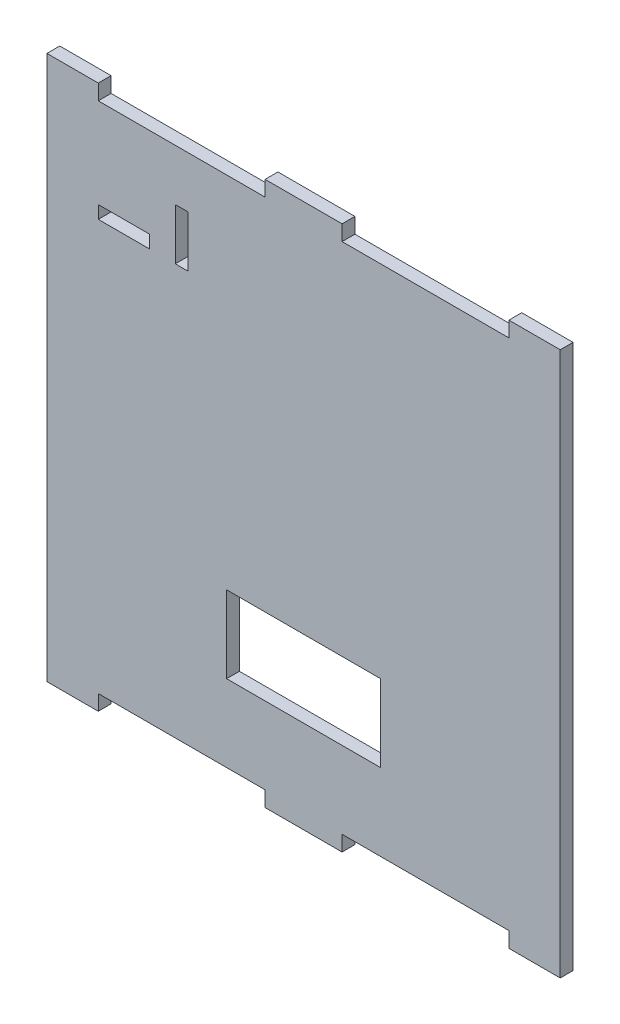
ISO-10303-21;
HEADER;
FILE_DESCRIPTION(('STEP AP214'),'2;1');
FILE_NAME('part.step','',(''),(''),'','','');
FILE_SCHEMA(('AUTOMOTIVE_DESIGN { 1 0 10303 214 1 1 1 1 }'));
ENDSEC;
DATA;
#1=APPLICATION_CONTEXT('core data for automotive mechanical design processes');
#2=APPLICATION_PROTOCOL_DEFINITION('international standard','automotive_design',2000,#1);
#3=PRODUCT_CONTEXT('',#1,'mechanical');
#4=PRODUCT('Part','Part','',(#3));
#5=PRODUCT_RELATED_PRODUCT_CATEGORY('part','',(#4));
#6=PRODUCT_DEFINITION_FORMATION('','',#4);
#7=PRODUCT_DEFINITION_CONTEXT('part definition',#1,'design');
#8=PRODUCT_DEFINITION('design','',#6,#7);
#9=PRODUCT_DEFINITION_SHAPE('','',#8);
#10=(LENGTH_UNIT() NAMED_UNIT(*) SI_UNIT(.MILLI.,.METRE.));
#11=(NAMED_UNIT(*) PLANE_ANGLE_UNIT() SI_UNIT($,.RADIAN.));
#12=(NAMED_UNIT(*) SI_UNIT($,.STERADIAN.) SOLID_ANGLE_UNIT());
#13=UNCERTAINTY_MEASURE_WITH_UNIT(LENGTH_MEASURE(1.E-05),#10,'distance_accuracy_value','');
#14=(GEOMETRIC_REPRESENTATION_CONTEXT(3) GLOBAL_UNCERTAINTY_ASSIGNED_CONTEXT((#13)) GLOBAL_UNIT_ASSIGNED_CONTEXT((#10,
#11,#12)) REPRESENTATION_CONTEXT('',''));
#15=CARTESIAN_POINT('',(0.,0.,0.));
#16=DIRECTION('',(0.,0.,1.));
#17=DIRECTION('',(1.,0.,0.));
#18=AXIS2_PLACEMENT_3D('',#15,#16,#17);
#19=CARTESIAN_POINT('',(0.,0.,5.));
#20=DIRECTION('',(0.,0.,-1.));
#21=DIRECTION('',(-1.,0.,0.));
#22=AXIS2_PLACEMENT_3D('',#19,#20,#21);
#23=PLANE('',#22);
#24=DIRECTION('',(0.,-1.,0.));
#25=VECTOR('',#24,1.);
#26=CARTESIAN_POINT('',(20.,166.,5.));
#27=LINE('',#26,#25);
#28=CARTESIAN_POINT('',(20.,171.,5.));
#29=VERTEX_POINT('',#28);
#30=CARTESIAN_POINT('',(20.,166.,5.));
#31=VERTEX_POINT('',#30);
#32=EDGE_CURVE('E278',#29,#31,#27,.T.);
#33=ORIENTED_EDGE('',*,*,#32,.F.);
#34=DIRECTION('',(-1.,0.,0.));
#35=VECTOR('',#34,1.);
#36=CARTESIAN_POINT('',(20.,171.,5.));
#37=LINE('',#36,#35);
#38=CARTESIAN_POINT('',(40.,171.,5.));
#39=VERTEX_POINT('',#38);
#40=EDGE_CURVE('E286',#39,#29,#37,.T.);
#41=ORIENTED_EDGE('',*,*,#40,.F.);
#42=DIRECTION('',(0.,1.,0.));
#43=VECTOR('',#42,1.);
#44=CARTESIAN_POINT('',(40.,166.,5.));
#45=LINE('',#44,#43);
#46=CARTESIAN_POINT('',(40.,166.,5.));
#47=VERTEX_POINT('',#46);
#48=EDGE_CURVE('E283',#47,#39,#45,.T.);
#49=ORIENTED_EDGE('',*,*,#48,.F.);
#50=DIRECTION('',(1.,0.,0.));
#51=VECTOR('',#50,1.);
#52=CARTESIAN_POINT('',(20.,166.,5.));
#53=LINE('',#52,#51);
#54=EDGE_CURVE('E280',#31,#47,#53,.T.);
#55=ORIENTED_EDGE('',*,*,#54,.F.);
#56=EDGE_LOOP('',(#33,#41,#49,#55));
#57=FACE_BOUND('',#56,.T.);
#58=DIRECTION('',(1.,0.,0.));
#59=VECTOR('',#58,1.);
#60=CARTESIAN_POINT('',(20.,0.,5.));
#61=LINE('',#60,#59);
#62=CARTESIAN_POINT('',(0.,0.,5.));
#63=VERTEX_POINT('',#62);
#64=CARTESIAN_POINT('',(20.,0.,5.));
#65=VERTEX_POINT('',#64);
#66=EDGE_CURVE('E340',#63,#65,#61,.T.);
#67=ORIENTED_EDGE('',*,*,#66,.T.);
#68=DIRECTION('',(0.,1.,0.));
#69=VECTOR('',#68,1.);
#70=CARTESIAN_POINT('',(20.,6.00000000000003,5.));
#71=LINE('',#70,#69);
#72=CARTESIAN_POINT('',(20.,6.00000000000003,5.));
#73=VERTEX_POINT('',#72);
#74=EDGE_CURVE('E343',#65,#73,#71,.T.);
#75=ORIENTED_EDGE('',*,*,#74,.T.);
#76=DIRECTION('',(1.,0.,0.));
#77=VECTOR('',#76,1.);
#78=CARTESIAN_POINT('',(20.,6.00000000000003,5.));
#79=LINE('',#78,#77);
#80=CARTESIAN_POINT('',(85.,6.00000000000003,5.));
#81=VERTEX_POINT('',#80);
#82=EDGE_CURVE('E346',#73,#81,#79,.T.);
#83=ORIENTED_EDGE('',*,*,#82,.T.);
#84=DIRECTION('',(0.,-1.,0.));
#85=VECTOR('',#84,1.);
#86=CARTESIAN_POINT('',(85.,6.00000000000003,5.));
#87=LINE('',#86,#85);
#88=CARTESIAN_POINT('',(85.,0.,5.));
#89=VERTEX_POINT('',#88);
#90=EDGE_CURVE('E348',#81,#89,#87,.T.);
#91=ORIENTED_EDGE('',*,*,#90,.T.);
#92=DIRECTION('',(1.,0.,0.));
#93=VECTOR('',#92,1.);
#94=CARTESIAN_POINT('',(85.,0.,5.));
#95=LINE('',#94,#93);
#96=CARTESIAN_POINT('',(115.,0.,5.));
#97=VERTEX_POINT('',#96);
#98=EDGE_CURVE('E350',#89,#97,#95,.T.);
#99=ORIENTED_EDGE('',*,*,#98,.T.);
#100=DIRECTION('',(0.,1.,0.));
#101=VECTOR('',#100,1.);
#102=CARTESIAN_POINT('',(115.,0.,5.));
#103=LINE('',#102,#101);
#104=CARTESIAN_POINT('',(115.,6.00000000000003,5.));
#105=VERTEX_POINT('',#104);
#106=EDGE_CURVE('E352',#97,#105,#103,.T.);
#107=ORIENTED_EDGE('',*,*,#106,.T.);
#108=DIRECTION('',(1.,0.,0.));
#109=VECTOR('',#108,1.);
#110=CARTESIAN_POINT('',(115.,6.00000000000003,5.));
#111=LINE('',#110,#109);
#112=CARTESIAN_POINT('',(180.,6.00000000000002,5.));
#113=VERTEX_POINT('',#112);
#114=EDGE_CURVE('E354',#105,#113,#111,.T.);
#115=ORIENTED_EDGE('',*,*,#114,.T.);
#116=DIRECTION('',(0.,-1.,0.));
#117=VECTOR('',#116,1.);
#118=CARTESIAN_POINT('',(180.,0.,5.));
#119=LINE('',#118,#117);
#120=CARTESIAN_POINT('',(180.,0.,5.));
#121=VERTEX_POINT('',#120);
#122=EDGE_CURVE('E356',#113,#121,#119,.T.);
#123=ORIENTED_EDGE('',*,*,#122,.T.);
#124=DIRECTION('',(1.,0.,0.));
#125=VECTOR('',#124,1.);
#126=CARTESIAN_POINT('',(200.,0.,5.));
#127=LINE('',#126,#125);
#128=CARTESIAN_POINT('',(200.,0.,5.));
#129=VERTEX_POINT('',#128);
#130=EDGE_CURVE('E358',#121,#129,#127,.T.);
#131=ORIENTED_EDGE('',*,*,#130,.T.);
#132=DIRECTION('',(0.,1.,0.));
#133=VECTOR('',#132,1.);
#134=CARTESIAN_POINT('',(200.,212.,5.));
#135=LINE('',#134,#133);
#136=CARTESIAN_POINT('',(200.,212.,5.));
#137=VERTEX_POINT('',#136);
#138=EDGE_CURVE('E360',#129,#137,#135,.T.);
#139=ORIENTED_EDGE('',*,*,#138,.T.);
#140=DIRECTION('',(-1.,0.,0.));
#141=VECTOR('',#140,1.);
#142=CARTESIAN_POINT('',(180.,212.,5.));
#143=LINE('',#142,#141);
#144=CARTESIAN_POINT('',(180.,212.,5.));
#145=VERTEX_POINT('',#144);
#146=EDGE_CURVE('E362',#137,#145,#143,.T.);
#147=ORIENTED_EDGE('',*,*,#146,.T.);
#148=DIRECTION('',(0.,-1.,0.));
#149=VECTOR('',#148,1.);
#150=CARTESIAN_POINT('',(180.,206.,5.));
#151=LINE('',#150,#149);
#152=CARTESIAN_POINT('',(180.,206.,5.));
#153=VERTEX_POINT('',#152);
#154=EDGE_CURVE('E364',#145,#153,#151,.T.);
#155=ORIENTED_EDGE('',*,*,#154,.T.);
#156=DIRECTION('',(-1.,0.,0.));
#157=VECTOR('',#156,1.);
#158=CARTESIAN_POINT('',(115.,206.,5.));
#159=LINE('',#158,#157);
#160=CARTESIAN_POINT('',(115.,206.,5.));
#161=VERTEX_POINT('',#160);
#162=EDGE_CURVE('E366',#153,#161,#159,.T.);
#163=ORIENTED_EDGE('',*,*,#162,.T.);
#164=DIRECTION('',(0.,1.,0.));
#165=VECTOR('',#164,1.);
#166=CARTESIAN_POINT('',(115.,212.,5.));
#167=LINE('',#166,#165);
#168=CARTESIAN_POINT('',(115.,212.,5.));
#169=VERTEX_POINT('',#168);
#170=EDGE_CURVE('E368',#161,#169,#167,.T.);
#171=ORIENTED_EDGE('',*,*,#170,.T.);
#172=DIRECTION('',(-1.,0.,0.));
#173=VECTOR('',#172,1.);
#174=CARTESIAN_POINT('',(85.,212.,5.));
#175=LINE('',#174,#173);
#176=CARTESIAN_POINT('',(85.,212.,5.));
#177=VERTEX_POINT('',#176);
#178=EDGE_CURVE('E370',#169,#177,#175,.T.);
#179=ORIENTED_EDGE('',*,*,#178,.T.);
#180=DIRECTION('',(0.,-1.,0.));
#181=VECTOR('',#180,1.);
#182=CARTESIAN_POINT('',(85.,206.,5.));
#183=LINE('',#182,#181);
#184=CARTESIAN_POINT('',(85.,206.,5.));
#185=VERTEX_POINT('',#184);
#186=EDGE_CURVE('E372',#177,#185,#183,.T.);
#187=ORIENTED_EDGE('',*,*,#186,.T.);
#188=DIRECTION('',(-1.,0.,0.));
#189=VECTOR('',#188,1.);
#190=CARTESIAN_POINT('',(20.,206.,5.));
#191=LINE('',#190,#189);
#192=CARTESIAN_POINT('',(20.,206.,5.));
#193=VERTEX_POINT('',#192);
#194=EDGE_CURVE('E374',#185,#193,#191,.T.);
#195=ORIENTED_EDGE('',*,*,#194,.T.);
#196=DIRECTION('',(0.,1.,0.));
#197=VECTOR('',#196,1.);
#198=CARTESIAN_POINT('',(20.,212.,5.));
#199=LINE('',#198,#197);
#200=CARTESIAN_POINT('',(20.,212.,5.));
#201=VERTEX_POINT('',#200);
#202=EDGE_CURVE('E376',#193,#201,#199,.T.);
#203=ORIENTED_EDGE('',*,*,#202,.T.);
#204=DIRECTION('',(-1.,0.,0.));
#205=VECTOR('',#204,1.);
#206=CARTESIAN_POINT('',(0.,212.,5.));
#207=LINE('',#206,#205);
#208=CARTESIAN_POINT('',(0.,212.,5.));
#209=VERTEX_POINT('',#208);
#210=EDGE_CURVE('E378',#201,#209,#207,.T.);
#211=ORIENTED_EDGE('',*,*,#210,.T.);
#212=DIRECTION('',(0.,-1.,0.));
#213=VECTOR('',#212,1.);
#214=CARTESIAN_POINT('',(0.,0.,5.));
#215=LINE('',#214,#213);
#216=EDGE_CURVE('E380',#209,#63,#215,.T.);
#217=ORIENTED_EDGE('',*,*,#216,.T.);
#218=EDGE_LOOP('',(#67,#75,#83,#91,#99,#107,#115,#123,#131,#139,#147,#155,#163,#171,#179,#187,
#195,#203,#211,#217));
#219=FACE_BOUND('',#218,.T.);
#220=DIRECTION('',(0.,-1.,0.));
#221=VECTOR('',#220,1.);
#222=CARTESIAN_POINT('',(70.,66.,5.));
#223=LINE('',#222,#221);
#224=CARTESIAN_POINT('',(70.,66.,5.));
#225=VERTEX_POINT('',#224);
#226=CARTESIAN_POINT('',(70.,36.,5.));
#227=VERTEX_POINT('',#226);
#228=EDGE_CURVE('E309',#225,#227,#223,.T.);
#229=ORIENTED_EDGE('',*,*,#228,.F.);
#230=DIRECTION('',(-1.,0.,0.));
#231=VECTOR('',#230,1.);
#232=CARTESIAN_POINT('',(70.,66.,5.));
#233=LINE('',#232,#231);
#234=CARTESIAN_POINT('',(130.,66.,5.));
#235=VERTEX_POINT('',#234);
#236=EDGE_CURVE('E317',#235,#225,#233,.T.);
#237=ORIENTED_EDGE('',*,*,#236,.F.);
#238=DIRECTION('',(0.,1.,0.));
#239=VECTOR('',#238,1.);
#240=CARTESIAN_POINT('',(130.,66.,5.));
#241=LINE('',#240,#239);
#242=CARTESIAN_POINT('',(130.,36.,5.));
#243=VERTEX_POINT('',#242);
#244=EDGE_CURVE('E314',#243,#235,#241,.T.);
#245=ORIENTED_EDGE('',*,*,#244,.F.);
#246=DIRECTION('',(1.,0.,0.));
#247=VECTOR('',#246,1.);
#248=CARTESIAN_POINT('',(70.,36.,5.));
#249=LINE('',#248,#247);
#250=EDGE_CURVE('E311',#227,#243,#249,.T.);
#251=ORIENTED_EDGE('',*,*,#250,.F.);
#252=EDGE_LOOP('',(#229,#237,#245,#251));
#253=FACE_BOUND('',#252,.T.);
#254=DIRECTION('',(0.,-1.,0.));
#255=VECTOR('',#254,1.);
#256=CARTESIAN_POINT('',(50.,186.,5.));
#257=LINE('',#256,#255);
#258=CARTESIAN_POINT('',(50.,186.,5.));
#259=VERTEX_POINT('',#258);
#260=CARTESIAN_POINT('',(50.,166.,5.));
#261=VERTEX_POINT('',#260);
#262=EDGE_CURVE('E242',#259,#261,#257,.T.);
#263=ORIENTED_EDGE('',*,*,#262,.F.);
#264=DIRECTION('',(-1.,0.,0.));
#265=VECTOR('',#264,1.);
#266=CARTESIAN_POINT('',(50.,186.,5.));
#267=LINE('',#266,#265);
#268=CARTESIAN_POINT('',(55.,186.,5.));
#269=VERTEX_POINT('',#268);
#270=EDGE_CURVE('E264',#269,#259,#267,.T.);
#271=ORIENTED_EDGE('',*,*,#270,.F.);
#272=DIRECTION('',(0.,1.,0.));
#273=VECTOR('',#272,1.);
#274=CARTESIAN_POINT('',(55.,186.,5.));
#275=LINE('',#274,#273);
#276=CARTESIAN_POINT('',(55.,166.,5.));
#277=VERTEX_POINT('',#276);
#278=EDGE_CURVE('E262',#277,#269,#275,.T.);
#279=ORIENTED_EDGE('',*,*,#278,.F.);
#280=DIRECTION('',(1.,0.,0.));
#281=VECTOR('',#280,1.);
#282=CARTESIAN_POINT('',(50.,166.,5.));
#283=LINE('',#282,#281);
#284=EDGE_CURVE('E250',#261,#277,#283,.T.);
#285=ORIENTED_EDGE('',*,*,#284,.F.);
#286=EDGE_LOOP('',(#263,#271,#279,#285));
#287=FACE_BOUND('',#286,.T.);
#288=ADVANCED_FACE('F33',(#57,#219,#253,#287),#23,.F.);
#289=CARTESIAN_POINT('',(0.,0.,0.));
#290=DIRECTION('',(0.,0.,-1.));
#291=DIRECTION('',(-1.,0.,0.));
#292=AXIS2_PLACEMENT_3D('',#289,#290,#291);
#293=PLANE('',#292);
#294=DIRECTION('',(1.,0.,0.));
#295=VECTOR('',#294,1.);
#296=CARTESIAN_POINT('',(20.,0.,0.));
#297=LINE('',#296,#295);
#298=CARTESIAN_POINT('',(0.,0.,0.));
#299=VERTEX_POINT('',#298);
#300=CARTESIAN_POINT('',(20.,0.,0.));
#301=VERTEX_POINT('',#300);
#302=EDGE_CURVE('E339',#299,#301,#297,.T.);
#303=ORIENTED_EDGE('',*,*,#302,.F.);
#304=DIRECTION('',(0.,-1.,0.));
#305=VECTOR('',#304,1.);
#306=CARTESIAN_POINT('',(0.,0.,0.));
#307=LINE('',#306,#305);
#308=CARTESIAN_POINT('',(0.,212.,0.));
#309=VERTEX_POINT('',#308);
#310=EDGE_CURVE('E344',#309,#299,#307,.T.);
#311=ORIENTED_EDGE('',*,*,#310,.F.);
#312=DIRECTION('',(-1.,0.,0.));
#313=VECTOR('',#312,1.);
#314=CARTESIAN_POINT('',(0.,212.,0.));
#315=LINE('',#314,#313);
#316=CARTESIAN_POINT('',(20.,212.,0.));
#317=VERTEX_POINT('',#316);
#318=EDGE_CURVE('E419',#317,#309,#315,.T.);
#319=ORIENTED_EDGE('',*,*,#318,.F.);
#320=DIRECTION('',(0.,1.,0.));
#321=VECTOR('',#320,1.);
#322=CARTESIAN_POINT('',(20.,212.,0.));
#323=LINE('',#322,#321);
#324=CARTESIAN_POINT('',(20.,206.,0.));
#325=VERTEX_POINT('',#324);
#326=EDGE_CURVE('E417',#325,#317,#323,.T.);
#327=ORIENTED_EDGE('',*,*,#326,.F.);
#328=DIRECTION('',(-1.,0.,0.));
#329=VECTOR('',#328,1.);
#330=CARTESIAN_POINT('',(20.,206.,0.));
#331=LINE('',#330,#329);
#332=CARTESIAN_POINT('',(85.,206.,0.));
#333=VERTEX_POINT('',#332);
#334=EDGE_CURVE('E415',#333,#325,#331,.T.);
#335=ORIENTED_EDGE('',*,*,#334,.F.);
#336=DIRECTION('',(0.,-1.,0.));
#337=VECTOR('',#336,1.);
#338=CARTESIAN_POINT('',(85.,206.,0.));
#339=LINE('',#338,#337);
#340=CARTESIAN_POINT('',(85.,212.,0.));
#341=VERTEX_POINT('',#340);
#342=EDGE_CURVE('E413',#341,#333,#339,.T.);
#343=ORIENTED_EDGE('',*,*,#342,.F.);
#344=DIRECTION('',(-1.,0.,0.));
#345=VECTOR('',#344,1.);
#346=CARTESIAN_POINT('',(85.,212.,0.));
#347=LINE('',#346,#345);
#348=CARTESIAN_POINT('',(115.,212.,0.));
#349=VERTEX_POINT('',#348);
#350=EDGE_CURVE('E411',#349,#341,#347,.T.);
#351=ORIENTED_EDGE('',*,*,#350,.F.);
#352=DIRECTION('',(0.,1.,0.));
#353=VECTOR('',#352,1.);
#354=CARTESIAN_POINT('',(115.,212.,0.));
#355=LINE('',#354,#353);
#356=CARTESIAN_POINT('',(115.,206.,0.));
#357=VERTEX_POINT('',#356);
#358=EDGE_CURVE('E409',#357,#349,#355,.T.);
#359=ORIENTED_EDGE('',*,*,#358,.F.);
#360=DIRECTION('',(-1.,0.,0.));
#361=VECTOR('',#360,1.);
#362=CARTESIAN_POINT('',(115.,206.,0.));
#363=LINE('',#362,#361);
#364=CARTESIAN_POINT('',(180.,206.,0.));
#365=VERTEX_POINT('',#364);
#366=EDGE_CURVE('E407',#365,#357,#363,.T.);
#367=ORIENTED_EDGE('',*,*,#366,.F.);
#368=DIRECTION('',(0.,-1.,0.));
#369=VECTOR('',#368,1.);
#370=CARTESIAN_POINT('',(180.,206.,0.));
#371=LINE('',#370,#369);
#372=CARTESIAN_POINT('',(180.,212.,0.));
#373=VERTEX_POINT('',#372);
#374=EDGE_CURVE('E405',#373,#365,#371,.T.);
#375=ORIENTED_EDGE('',*,*,#374,.F.);
#376=DIRECTION('',(-1.,0.,0.));
#377=VECTOR('',#376,1.);
#378=CARTESIAN_POINT('',(180.,212.,0.));
#379=LINE('',#378,#377);
#380=CARTESIAN_POINT('',(200.,212.,0.));
#381=VERTEX_POINT('',#380);
#382=EDGE_CURVE('E403',#381,#373,#379,.T.);
#383=ORIENTED_EDGE('',*,*,#382,.F.);
#384=DIRECTION('',(0.,1.,0.));
#385=VECTOR('',#384,1.);
#386=CARTESIAN_POINT('',(200.,212.,0.));
#387=LINE('',#386,#385);
#388=CARTESIAN_POINT('',(200.,0.,0.));
#389=VERTEX_POINT('',#388);
#390=EDGE_CURVE('E401',#389,#381,#387,.T.);
#391=ORIENTED_EDGE('',*,*,#390,.F.);
#392=DIRECTION('',(1.,0.,0.));
#393=VECTOR('',#392,1.);
#394=CARTESIAN_POINT('',(200.,0.,0.));
#395=LINE('',#394,#393);
#396=CARTESIAN_POINT('',(180.,0.,0.));
#397=VERTEX_POINT('',#396);
#398=EDGE_CURVE('E399',#397,#389,#395,.T.);
#399=ORIENTED_EDGE('',*,*,#398,.F.);
#400=DIRECTION('',(0.,-1.,0.));
#401=VECTOR('',#400,1.);
#402=CARTESIAN_POINT('',(180.,0.,0.));
#403=LINE('',#402,#401);
#404=CARTESIAN_POINT('',(180.,6.00000000000002,0.));
#405=VERTEX_POINT('',#404);
#406=EDGE_CURVE('E397',#405,#397,#403,.T.);
#407=ORIENTED_EDGE('',*,*,#406,.F.);
#408=DIRECTION('',(1.,0.,0.));
#409=VECTOR('',#408,1.);
#410=CARTESIAN_POINT('',(115.,6.00000000000003,0.));
#411=LINE('',#410,#409);
#412=CARTESIAN_POINT('',(115.,6.00000000000003,0.));
#413=VERTEX_POINT('',#412);
#414=EDGE_CURVE('E395',#413,#405,#411,.T.);
#415=ORIENTED_EDGE('',*,*,#414,.F.);
#416=DIRECTION('',(0.,1.,0.));
#417=VECTOR('',#416,1.);
#418=CARTESIAN_POINT('',(115.,0.,0.));
#419=LINE('',#418,#417);
#420=CARTESIAN_POINT('',(115.,0.,0.));
#421=VERTEX_POINT('',#420);
#422=EDGE_CURVE('E393',#421,#413,#419,.T.);
#423=ORIENTED_EDGE('',*,*,#422,.F.);
#424=DIRECTION('',(1.,0.,0.));
#425=VECTOR('',#424,1.);
#426=CARTESIAN_POINT('',(85.,0.,0.));
#427=LINE('',#426,#425);
#428=CARTESIAN_POINT('',(85.,0.,0.));
#429=VERTEX_POINT('',#428);
#430=EDGE_CURVE('E391',#429,#421,#427,.T.);
#431=ORIENTED_EDGE('',*,*,#430,.F.);
#432=DIRECTION('',(0.,-1.,0.));
#433=VECTOR('',#432,1.);
#434=CARTESIAN_POINT('',(85.,6.00000000000003,0.));
#435=LINE('',#434,#433);
#436=CARTESIAN_POINT('',(85.,6.00000000000003,0.));
#437=VERTEX_POINT('',#436);
#438=EDGE_CURVE('E389',#437,#429,#435,.T.);
#439=ORIENTED_EDGE('',*,*,#438,.F.);
#440=DIRECTION('',(1.,0.,0.));
#441=VECTOR('',#440,1.);
#442=CARTESIAN_POINT('',(20.,6.00000000000003,0.));
#443=LINE('',#442,#441);
#444=CARTESIAN_POINT('',(20.,6.00000000000003,0.));
#445=VERTEX_POINT('',#444);
#446=EDGE_CURVE('E387',#445,#437,#443,.T.);
#447=ORIENTED_EDGE('',*,*,#446,.F.);
#448=DIRECTION('',(0.,1.,0.));
#449=VECTOR('',#448,1.);
#450=CARTESIAN_POINT('',(20.,6.00000000000003,0.));
#451=LINE('',#450,#449);
#452=EDGE_CURVE('E385',#301,#445,#451,.T.);
#453=ORIENTED_EDGE('',*,*,#452,.F.);
#454=EDGE_LOOP('',(#303,#311,#319,#327,#335,#343,#351,#359,#367,#375,#383,#391,#399,#407,#415,
#423,#431,#439,#447,#453));
#455=FACE_BOUND('',#454,.T.);
#456=DIRECTION('',(-1.,0.,0.));
#457=VECTOR('',#456,1.);
#458=CARTESIAN_POINT('',(70.,66.,0.));
#459=LINE('',#458,#457);
#460=CARTESIAN_POINT('',(130.,66.,0.));
#461=VERTEX_POINT('',#460);
#462=CARTESIAN_POINT('',(70.,66.,0.));
#463=VERTEX_POINT('',#462);
#464=EDGE_CURVE('E312',#461,#463,#459,.T.);
#465=ORIENTED_EDGE('',*,*,#464,.T.);
#466=DIRECTION('',(0.,-1.,0.));
#467=VECTOR('',#466,1.);
#468=CARTESIAN_POINT('',(70.,66.,0.));
#469=LINE('',#468,#467);
#470=CARTESIAN_POINT('',(70.,36.,0.));
#471=VERTEX_POINT('',#470);
#472=EDGE_CURVE('E308',#463,#471,#469,.T.);
#473=ORIENTED_EDGE('',*,*,#472,.T.);
#474=DIRECTION('',(1.,0.,0.));
#475=VECTOR('',#474,1.);
#476=CARTESIAN_POINT('',(70.,36.,0.));
#477=LINE('',#476,#475);
#478=CARTESIAN_POINT('',(130.,36.,0.));
#479=VERTEX_POINT('',#478);
#480=EDGE_CURVE('E322',#471,#479,#477,.T.);
#481=ORIENTED_EDGE('',*,*,#480,.T.);
#482=DIRECTION('',(0.,1.,0.));
#483=VECTOR('',#482,1.);
#484=CARTESIAN_POINT('',(130.,66.,0.));
#485=LINE('',#484,#483);
#486=EDGE_CURVE('E325',#479,#461,#485,.T.);
#487=ORIENTED_EDGE('',*,*,#486,.T.);
#488=EDGE_LOOP('',(#465,#473,#481,#487));
#489=FACE_BOUND('',#488,.T.);
#490=DIRECTION('',(-1.,0.,0.));
#491=VECTOR('',#490,1.);
#492=CARTESIAN_POINT('',(20.,171.,0.));
#493=LINE('',#492,#491);
#494=CARTESIAN_POINT('',(40.,171.,0.));
#495=VERTEX_POINT('',#494);
#496=CARTESIAN_POINT('',(20.,171.,0.));
#497=VERTEX_POINT('',#496);
#498=EDGE_CURVE('E281',#495,#497,#493,.T.);
#499=ORIENTED_EDGE('',*,*,#498,.T.);
#500=DIRECTION('',(0.,-1.,0.));
#501=VECTOR('',#500,1.);
#502=CARTESIAN_POINT('',(20.,166.,0.));
#503=LINE('',#502,#501);
#504=CARTESIAN_POINT('',(20.,166.,0.));
#505=VERTEX_POINT('',#504);
#506=EDGE_CURVE('E258',#497,#505,#503,.T.);
#507=ORIENTED_EDGE('',*,*,#506,.T.);
#508=DIRECTION('',(1.,0.,0.));
#509=VECTOR('',#508,1.);
#510=CARTESIAN_POINT('',(20.,166.,0.));
#511=LINE('',#510,#509);
#512=CARTESIAN_POINT('',(40.,166.,0.));
#513=VERTEX_POINT('',#512);
#514=EDGE_CURVE('E291',#505,#513,#511,.T.);
#515=ORIENTED_EDGE('',*,*,#514,.T.);
#516=DIRECTION('',(0.,1.,0.));
#517=VECTOR('',#516,1.);
#518=CARTESIAN_POINT('',(40.,166.,0.));
#519=LINE('',#518,#517);
#520=EDGE_CURVE('E294',#513,#495,#519,.T.);
#521=ORIENTED_EDGE('',*,*,#520,.T.);
#522=EDGE_LOOP('',(#499,#507,#515,#521));
#523=FACE_BOUND('',#522,.T.);
#524=DIRECTION('',(-1.,0.,0.));
#525=VECTOR('',#524,1.);
#526=CARTESIAN_POINT('',(50.,186.,0.));
#527=LINE('',#526,#525);
#528=CARTESIAN_POINT('',(55.,186.,0.));
#529=VERTEX_POINT('',#528);
#530=CARTESIAN_POINT('',(50.,186.,0.));
#531=VERTEX_POINT('',#530);
#532=EDGE_CURVE('E251',#529,#531,#527,.T.);
#533=ORIENTED_EDGE('',*,*,#532,.T.);
#534=DIRECTION('',(0.,-1.,0.));
#535=VECTOR('',#534,1.);
#536=CARTESIAN_POINT('',(50.,186.,0.));
#537=LINE('',#536,#535);
#538=CARTESIAN_POINT('',(50.,166.,0.));
#539=VERTEX_POINT('',#538);
#540=EDGE_CURVE('E56',#531,#539,#537,.T.);
#541=ORIENTED_EDGE('',*,*,#540,.T.);
#542=DIRECTION('',(1.,0.,0.));
#543=VECTOR('',#542,1.);
#544=CARTESIAN_POINT('',(50.,166.,0.));
#545=LINE('',#544,#543);
#546=CARTESIAN_POINT('',(55.,166.,0.));
#547=VERTEX_POINT('',#546);
#548=EDGE_CURVE('E257',#539,#547,#545,.T.);
#549=ORIENTED_EDGE('',*,*,#548,.T.);
#550=DIRECTION('',(0.,1.,0.));
#551=VECTOR('',#550,1.);
#552=CARTESIAN_POINT('',(55.,186.,0.));
#553=LINE('',#552,#551);
#554=EDGE_CURVE('E270',#547,#529,#553,.T.);
#555=ORIENTED_EDGE('',*,*,#554,.T.);
#556=EDGE_LOOP('',(#533,#541,#549,#555));
#557=FACE_BOUND('',#556,.T.);
#558=ADVANCED_FACE('F485',(#455,#489,#523,#557),#293,.T.);
#559=CARTESIAN_POINT('',(20.,0.,5.));
#560=DIRECTION('',(0.,1.,0.));
#561=DIRECTION('',(0.,0.,1.));
#562=AXIS2_PLACEMENT_3D('',#559,#560,#561);
#563=PLANE('',#562);
#564=ORIENTED_EDGE('',*,*,#302,.T.);
#565=DIRECTION('',(0.,0.,-1.));
#566=VECTOR('',#565,1.);
#567=CARTESIAN_POINT('',(20.,0.,5.));
#568=LINE('',#567,#566);
#569=EDGE_CURVE('E11',#65,#301,#568,.T.);
#570=ORIENTED_EDGE('',*,*,#569,.F.);
#571=ORIENTED_EDGE('',*,*,#66,.F.);
#572=DIRECTION('',(0.,0.,-1.));
#573=VECTOR('',#572,1.);
#574=CARTESIAN_POINT('',(0.,0.,5.));
#575=LINE('',#574,#573);
#576=EDGE_CURVE('E382',#63,#299,#575,.T.);
#577=ORIENTED_EDGE('',*,*,#576,.T.);
#578=EDGE_LOOP('',(#564,#570,#571,#577));
#579=FACE_BOUND('',#578,.T.);
#580=ADVANCED_FACE('F35',(#579),#563,.F.);
#581=CARTESIAN_POINT('',(20.,6.00000000000003,5.));
#582=DIRECTION('',(-1.,0.,0.));
#583=DIRECTION('',(0.,0.,1.));
#584=AXIS2_PLACEMENT_3D('',#581,#582,#583);
#585=PLANE('',#584);
#586=ORIENTED_EDGE('',*,*,#452,.T.);
#587=DIRECTION('',(0.,0.,-1.));
#588=VECTOR('',#587,1.);
#589=CARTESIAN_POINT('',(20.,6.00000000000003,5.));
#590=LINE('',#589,#588);
#591=EDGE_CURVE('E41',#73,#445,#590,.T.);
#592=ORIENTED_EDGE('',*,*,#591,.F.);
#593=ORIENTED_EDGE('',*,*,#74,.F.);
#594=ORIENTED_EDGE('',*,*,#569,.T.);
#595=EDGE_LOOP('',(#586,#592,#593,#594));
#596=FACE_BOUND('',#595,.T.);
#597=ADVANCED_FACE('F503',(#596),#585,.F.);
#598=CARTESIAN_POINT('',(20.,6.00000000000003,5.));
#599=DIRECTION('',(0.,1.,0.));
#600=DIRECTION('',(0.,0.,1.));
#601=AXIS2_PLACEMENT_3D('',#598,#599,#600);
#602=PLANE('',#601);
#603=ORIENTED_EDGE('',*,*,#446,.T.);
#604=DIRECTION('',(0.,0.,-1.));
#605=VECTOR('',#604,1.);
#606=CARTESIAN_POINT('',(85.,6.00000000000003,5.));
#607=LINE('',#606,#605);
#608=EDGE_CURVE('E472',#81,#437,#607,.T.);
#609=ORIENTED_EDGE('',*,*,#608,.F.);
#610=ORIENTED_EDGE('',*,*,#82,.F.);
#611=ORIENTED_EDGE('',*,*,#591,.T.);
#612=EDGE_LOOP('',(#603,#609,#610,#611));
#613=FACE_BOUND('',#612,.T.);
#614=ADVANCED_FACE('F479',(#613),#602,.F.);
#615=CARTESIAN_POINT('',(85.,6.00000000000003,5.));
#616=DIRECTION('',(1.,0.,0.));
#617=DIRECTION('',(0.,0.,-1.));
#618=AXIS2_PLACEMENT_3D('',#615,#616,#617);
#619=PLANE('',#618);
#620=ORIENTED_EDGE('',*,*,#438,.T.);
#621=DIRECTION('',(0.,0.,-1.));
#622=VECTOR('',#621,1.);
#623=CARTESIAN_POINT('',(85.,0.,5.));
#624=LINE('',#623,#622);
#625=EDGE_CURVE('E469',#89,#429,#624,.T.);
#626=ORIENTED_EDGE('',*,*,#625,.F.);
#627=ORIENTED_EDGE('',*,*,#90,.F.);
#628=ORIENTED_EDGE('',*,*,#608,.T.);
#629=EDGE_LOOP('',(#620,#626,#627,#628));
#630=FACE_BOUND('',#629,.T.);
#631=ADVANCED_FACE('F491',(#630),#619,.F.);
#632=CARTESIAN_POINT('',(85.,0.,5.));
#633=DIRECTION('',(0.,1.,0.));
#634=DIRECTION('',(0.,0.,1.));
#635=AXIS2_PLACEMENT_3D('',#632,#633,#634);
#636=PLANE('',#635);
#637=ORIENTED_EDGE('',*,*,#430,.T.);
#638=DIRECTION('',(0.,0.,-1.));
#639=VECTOR('',#638,1.);
#640=CARTESIAN_POINT('',(115.,0.,5.));
#641=LINE('',#640,#639);
#642=EDGE_CURVE('E466',#97,#421,#641,.T.);
#643=ORIENTED_EDGE('',*,*,#642,.F.);
#644=ORIENTED_EDGE('',*,*,#98,.F.);
#645=ORIENTED_EDGE('',*,*,#625,.T.);
#646=EDGE_LOOP('',(#637,#643,#644,#645));
#647=FACE_BOUND('',#646,.T.);
#648=ADVANCED_FACE('F495',(#647),#636,.F.);
#649=CARTESIAN_POINT('',(115.,0.,5.));
#650=DIRECTION('',(-1.,0.,0.));
#651=DIRECTION('',(0.,0.,1.));
#652=AXIS2_PLACEMENT_3D('',#649,#650,#651);
#653=PLANE('',#652);
#654=ORIENTED_EDGE('',*,*,#422,.T.);
#655=DIRECTION('',(0.,0.,-1.));
#656=VECTOR('',#655,1.);
#657=CARTESIAN_POINT('',(115.,6.00000000000003,5.));
#658=LINE('',#657,#656);
#659=EDGE_CURVE('E463',#105,#413,#658,.T.);
#660=ORIENTED_EDGE('',*,*,#659,.F.);
#661=ORIENTED_EDGE('',*,*,#106,.F.);
#662=ORIENTED_EDGE('',*,*,#642,.T.);
#663=EDGE_LOOP('',(#654,#660,#661,#662));
#664=FACE_BOUND('',#663,.T.);
#665=ADVANCED_FACE('F576',(#664),#653,.F.);
#666=CARTESIAN_POINT('',(115.,6.00000000000003,5.));
#667=DIRECTION('',(0.,1.,0.));
#668=DIRECTION('',(-1.,0.,0.));
#669=AXIS2_PLACEMENT_3D('',#666,#667,#668);
#670=PLANE('',#669);
#671=ORIENTED_EDGE('',*,*,#414,.T.);
#672=DIRECTION('',(0.,0.,-1.));
#673=VECTOR('',#672,1.);
#674=CARTESIAN_POINT('',(180.,6.00000000000002,5.));
#675=LINE('',#674,#673);
#676=EDGE_CURVE('E460',#113,#405,#675,.T.);
#677=ORIENTED_EDGE('',*,*,#676,.F.);
#678=ORIENTED_EDGE('',*,*,#114,.F.);
#679=ORIENTED_EDGE('',*,*,#659,.T.);
#680=EDGE_LOOP('',(#671,#677,#678,#679));
#681=FACE_BOUND('',#680,.T.);
#682=ADVANCED_FACE('F574',(#681),#670,.F.);
#683=CARTESIAN_POINT('',(180.,0.,5.));
#684=DIRECTION('',(1.,0.,0.));
#685=DIRECTION('',(0.,0.,-1.));
#686=AXIS2_PLACEMENT_3D('',#683,#684,#685);
#687=PLANE('',#686);
#688=ORIENTED_EDGE('',*,*,#406,.T.);
#689=DIRECTION('',(0.,0.,-1.));
#690=VECTOR('',#689,1.);
#691=CARTESIAN_POINT('',(180.,0.,5.));
#692=LINE('',#691,#690);
#693=EDGE_CURVE('E457',#121,#397,#692,.T.);
#694=ORIENTED_EDGE('',*,*,#693,.F.);
#695=ORIENTED_EDGE('',*,*,#122,.F.);
#696=ORIENTED_EDGE('',*,*,#676,.T.);
#697=EDGE_LOOP('',(#688,#694,#695,#696));
#698=FACE_BOUND('',#697,.T.);
#699=ADVANCED_FACE('F569',(#698),#687,.F.);
#700=CARTESIAN_POINT('',(200.,0.,5.));
#701=DIRECTION('',(0.,1.,0.));
#702=DIRECTION('',(-1.,0.,0.));
#703=AXIS2_PLACEMENT_3D('',#700,#701,#702);
#704=PLANE('',#703);
#705=ORIENTED_EDGE('',*,*,#398,.T.);
#706=DIRECTION('',(0.,0.,-1.));
#707=VECTOR('',#706,1.);
#708=CARTESIAN_POINT('',(200.,0.,5.));
#709=LINE('',#708,#707);
#710=EDGE_CURVE('E454',#129,#389,#709,.T.);
#711=ORIENTED_EDGE('',*,*,#710,.F.);
#712=ORIENTED_EDGE('',*,*,#130,.F.);
#713=ORIENTED_EDGE('',*,*,#693,.T.);
#714=EDGE_LOOP('',(#705,#711,#712,#713));
#715=FACE_BOUND('',#714,.T.);
#716=ADVANCED_FACE('F564',(#715),#704,.F.);
#717=CARTESIAN_POINT('',(200.,212.,5.));
#718=DIRECTION('',(-1.,0.,0.));
#719=DIRECTION('',(0.,-1.,0.));
#720=AXIS2_PLACEMENT_3D('',#717,#718,#719);
#721=PLANE('',#720);
#722=ORIENTED_EDGE('',*,*,#390,.T.);
#723=DIRECTION('',(0.,0.,-1.));
#724=VECTOR('',#723,1.);
#725=CARTESIAN_POINT('',(200.,212.,5.));
#726=LINE('',#725,#724);
#727=EDGE_CURVE('E451',#137,#381,#726,.T.);
#728=ORIENTED_EDGE('',*,*,#727,.F.);
#729=ORIENTED_EDGE('',*,*,#138,.F.);
#730=ORIENTED_EDGE('',*,*,#710,.T.);
#731=EDGE_LOOP('',(#722,#728,#729,#730));
#732=FACE_BOUND('',#731,.T.);
#733=ADVANCED_FACE('F560',(#732),#721,.F.);
#734=CARTESIAN_POINT('',(180.,212.,5.));
#735=DIRECTION('',(0.,-1.,0.));
#736=DIRECTION('',(1.,0.,0.));
#737=AXIS2_PLACEMENT_3D('',#734,#735,#736);
#738=PLANE('',#737);
#739=ORIENTED_EDGE('',*,*,#382,.T.);
#740=DIRECTION('',(0.,0.,-1.));
#741=VECTOR('',#740,1.);
#742=CARTESIAN_POINT('',(180.,212.,5.));
#743=LINE('',#742,#741);
#744=EDGE_CURVE('E448',#145,#373,#743,.T.);
#745=ORIENTED_EDGE('',*,*,#744,.F.);
#746=ORIENTED_EDGE('',*,*,#146,.F.);
#747=ORIENTED_EDGE('',*,*,#727,.T.);
#748=EDGE_LOOP('',(#739,#745,#746,#747));
#749=FACE_BOUND('',#748,.T.);
#750=ADVANCED_FACE('F555',(#749),#738,.F.);
#751=CARTESIAN_POINT('',(180.,206.,5.));
#752=DIRECTION('',(1.,0.,0.));
#753=DIRECTION('',(0.,1.,0.));
#754=AXIS2_PLACEMENT_3D('',#751,#752,#753);
#755=PLANE('',#754);
#756=ORIENTED_EDGE('',*,*,#374,.T.);
#757=DIRECTION('',(0.,0.,-1.));
#758=VECTOR('',#757,1.);
#759=CARTESIAN_POINT('',(180.,206.,5.));
#760=LINE('',#759,#758);
#761=EDGE_CURVE('E445',#153,#365,#760,.T.);
#762=ORIENTED_EDGE('',*,*,#761,.F.);
#763=ORIENTED_EDGE('',*,*,#154,.F.);
#764=ORIENTED_EDGE('',*,*,#744,.T.);
#765=EDGE_LOOP('',(#756,#762,#763,#764));
#766=FACE_BOUND('',#765,.T.);
#767=ADVANCED_FACE('F549',(#766),#755,.F.);
#768=CARTESIAN_POINT('',(115.,206.,5.));
#769=DIRECTION('',(0.,-1.,0.));
#770=DIRECTION('',(1.,0.,0.));
#771=AXIS2_PLACEMENT_3D('',#768,#769,#770);
#772=PLANE('',#771);
#773=ORIENTED_EDGE('',*,*,#366,.T.);
#774=DIRECTION('',(0.,0.,-1.));
#775=VECTOR('',#774,1.);
#776=CARTESIAN_POINT('',(115.,206.,5.));
#777=LINE('',#776,#775);
#778=EDGE_CURVE('E442',#161,#357,#777,.T.);
#779=ORIENTED_EDGE('',*,*,#778,.F.);
#780=ORIENTED_EDGE('',*,*,#162,.F.);
#781=ORIENTED_EDGE('',*,*,#761,.T.);
#782=EDGE_LOOP('',(#773,#779,#780,#781));
#783=FACE_BOUND('',#782,.T.);
#784=ADVANCED_FACE('F545',(#783),#772,.F.);
#785=CARTESIAN_POINT('',(115.,212.,5.));
#786=DIRECTION('',(-1.,0.,0.));
#787=DIRECTION('',(0.,0.,1.));
#788=AXIS2_PLACEMENT_3D('',#785,#786,#787);
#789=PLANE('',#788);
#790=ORIENTED_EDGE('',*,*,#358,.T.);
#791=DIRECTION('',(0.,0.,-1.));
#792=VECTOR('',#791,1.);
#793=CARTESIAN_POINT('',(115.,212.,5.));
#794=LINE('',#793,#792);
#795=EDGE_CURVE('E439',#169,#349,#794,.T.);
#796=ORIENTED_EDGE('',*,*,#795,.F.);
#797=ORIENTED_EDGE('',*,*,#170,.F.);
#798=ORIENTED_EDGE('',*,*,#778,.T.);
#799=EDGE_LOOP('',(#790,#796,#797,#798));
#800=FACE_BOUND('',#799,.T.);
#801=ADVANCED_FACE('F540',(#800),#789,.F.);
#802=CARTESIAN_POINT('',(85.,212.,5.));
#803=DIRECTION('',(0.,-1.,0.));
#804=DIRECTION('',(1.,0.,0.));
#805=AXIS2_PLACEMENT_3D('',#802,#803,#804);
#806=PLANE('',#805);
#807=ORIENTED_EDGE('',*,*,#350,.T.);
#808=DIRECTION('',(0.,0.,-1.));
#809=VECTOR('',#808,1.);
#810=CARTESIAN_POINT('',(85.,212.,5.));
#811=LINE('',#810,#809);
#812=EDGE_CURVE('E436',#177,#341,#811,.T.);
#813=ORIENTED_EDGE('',*,*,#812,.F.);
#814=ORIENTED_EDGE('',*,*,#178,.F.);
#815=ORIENTED_EDGE('',*,*,#795,.T.);
#816=EDGE_LOOP('',(#807,#813,#814,#815));
#817=FACE_BOUND('',#816,.T.);
#818=ADVANCED_FACE('F534',(#817),#806,.F.);
#819=CARTESIAN_POINT('',(85.,206.,5.));
#820=DIRECTION('',(1.,0.,0.));
#821=DIRECTION('',(0.,0.,-1.));
#822=AXIS2_PLACEMENT_3D('',#819,#820,#821);
#823=PLANE('',#822);
#824=ORIENTED_EDGE('',*,*,#342,.T.);
#825=DIRECTION('',(0.,0.,-1.));
#826=VECTOR('',#825,1.);
#827=CARTESIAN_POINT('',(85.,206.,5.));
#828=LINE('',#827,#826);
#829=EDGE_CURVE('E433',#185,#333,#828,.T.);
#830=ORIENTED_EDGE('',*,*,#829,.F.);
#831=ORIENTED_EDGE('',*,*,#186,.F.);
#832=ORIENTED_EDGE('',*,*,#812,.T.);
#833=EDGE_LOOP('',(#824,#830,#831,#832));
#834=FACE_BOUND('',#833,.T.);
#835=ADVANCED_FACE('F530',(#834),#823,.F.);
#836=CARTESIAN_POINT('',(20.,206.,5.));
#837=DIRECTION('',(0.,-1.,0.));
#838=DIRECTION('',(0.,0.,-1.));
#839=AXIS2_PLACEMENT_3D('',#836,#837,#838);
#840=PLANE('',#839);
#841=ORIENTED_EDGE('',*,*,#334,.T.);
#842=DIRECTION('',(0.,0.,-1.));
#843=VECTOR('',#842,1.);
#844=CARTESIAN_POINT('',(20.,206.,5.));
#845=LINE('',#844,#843);
#846=EDGE_CURVE('E430',#193,#325,#845,.T.);
#847=ORIENTED_EDGE('',*,*,#846,.F.);
#848=ORIENTED_EDGE('',*,*,#194,.F.);
#849=ORIENTED_EDGE('',*,*,#829,.T.);
#850=EDGE_LOOP('',(#841,#847,#848,#849));
#851=FACE_BOUND('',#850,.T.);
#852=ADVANCED_FACE('F525',(#851),#840,.F.);
#853=CARTESIAN_POINT('',(20.,212.,5.));
#854=DIRECTION('',(-1.,0.,0.));
#855=DIRECTION('',(0.,-1.,0.));
#856=AXIS2_PLACEMENT_3D('',#853,#854,#855);
#857=PLANE('',#856);
#858=ORIENTED_EDGE('',*,*,#326,.T.);
#859=DIRECTION('',(0.,0.,-1.));
#860=VECTOR('',#859,1.);
#861=CARTESIAN_POINT('',(20.,212.,5.));
#862=LINE('',#861,#860);
#863=EDGE_CURVE('E427',#201,#317,#862,.T.);
#864=ORIENTED_EDGE('',*,*,#863,.F.);
#865=ORIENTED_EDGE('',*,*,#202,.F.);
#866=ORIENTED_EDGE('',*,*,#846,.T.);
#867=EDGE_LOOP('',(#858,#864,#865,#866));
#868=FACE_BOUND('',#867,.T.);
#869=ADVANCED_FACE('F519',(#868),#857,.F.);
#870=CARTESIAN_POINT('',(0.,212.,5.));
#871=DIRECTION('',(0.,-1.,0.));
#872=DIRECTION('',(0.,0.,-1.));
#873=AXIS2_PLACEMENT_3D('',#870,#871,#872);
#874=PLANE('',#873);
#875=ORIENTED_EDGE('',*,*,#318,.T.);
#876=DIRECTION('',(0.,0.,-1.));
#877=VECTOR('',#876,1.);
#878=CARTESIAN_POINT('',(0.,212.,5.));
#879=LINE('',#878,#877);
#880=EDGE_CURVE('E424',#209,#309,#879,.T.);
#881=ORIENTED_EDGE('',*,*,#880,.F.);
#882=ORIENTED_EDGE('',*,*,#210,.F.);
#883=ORIENTED_EDGE('',*,*,#863,.T.);
#884=EDGE_LOOP('',(#875,#881,#882,#883));
#885=FACE_BOUND('',#884,.T.);
#886=ADVANCED_FACE('F515',(#885),#874,.F.);
#887=CARTESIAN_POINT('',(0.,0.,5.));
#888=DIRECTION('',(1.,0.,0.));
#889=DIRECTION('',(0.,1.,0.));
#890=AXIS2_PLACEMENT_3D('',#887,#888,#889);
#891=PLANE('',#890);
#892=ORIENTED_EDGE('',*,*,#310,.T.);
#893=ORIENTED_EDGE('',*,*,#576,.F.);
#894=ORIENTED_EDGE('',*,*,#216,.F.);
#895=ORIENTED_EDGE('',*,*,#880,.T.);
#896=EDGE_LOOP('',(#892,#893,#894,#895));
#897=FACE_BOUND('',#896,.T.);
#898=ADVANCED_FACE('F510',(#897),#891,.F.);
#899=CARTESIAN_POINT('',(70.,66.,5.));
#900=DIRECTION('',(1.,0.,0.));
#901=DIRECTION('',(0.,0.,-1.));
#902=AXIS2_PLACEMENT_3D('',#899,#900,#901);
#903=PLANE('',#902);
#904=ORIENTED_EDGE('',*,*,#472,.F.);
#905=DIRECTION('',(0.,0.,-1.));
#906=VECTOR('',#905,1.);
#907=CARTESIAN_POINT('',(70.,66.,5.));
#908=LINE('',#907,#906);
#909=EDGE_CURVE('E319',#225,#463,#908,.T.);
#910=ORIENTED_EDGE('',*,*,#909,.F.);
#911=ORIENTED_EDGE('',*,*,#228,.T.);
#912=DIRECTION('',(0.,0.,-1.));
#913=VECTOR('',#912,1.);
#914=CARTESIAN_POINT('',(70.,36.,5.));
#915=LINE('',#914,#913);
#916=EDGE_CURVE('E336',#227,#471,#915,.T.);
#917=ORIENTED_EDGE('',*,*,#916,.T.);
#918=EDGE_LOOP('',(#904,#910,#911,#917));
#919=FACE_BOUND('',#918,.T.);
#920=ADVANCED_FACE('F594',(#919),#903,.T.);
#921=CARTESIAN_POINT('',(70.,36.,5.));
#922=DIRECTION('',(0.,1.,0.));
#923=DIRECTION('',(0.,0.,1.));
#924=AXIS2_PLACEMENT_3D('',#921,#922,#923);
#925=PLANE('',#924);
#926=ORIENTED_EDGE('',*,*,#480,.F.);
#927=ORIENTED_EDGE('',*,*,#916,.F.);
#928=ORIENTED_EDGE('',*,*,#250,.T.);
#929=DIRECTION('',(0.,0.,-1.));
#930=VECTOR('',#929,1.);
#931=CARTESIAN_POINT('',(130.,36.,5.));
#932=LINE('',#931,#930);
#933=EDGE_CURVE('E334',#243,#479,#932,.T.);
#934=ORIENTED_EDGE('',*,*,#933,.T.);
#935=EDGE_LOOP('',(#926,#927,#928,#934));
#936=FACE_BOUND('',#935,.T.);
#937=ADVANCED_FACE('F680',(#936),#925,.T.);
#938=CARTESIAN_POINT('',(130.,66.,5.));
#939=DIRECTION('',(-1.,0.,0.));
#940=DIRECTION('',(0.,-1.,0.));
#941=AXIS2_PLACEMENT_3D('',#938,#939,#940);
#942=PLANE('',#941);
#943=ORIENTED_EDGE('',*,*,#486,.F.);
#944=ORIENTED_EDGE('',*,*,#933,.F.);
#945=ORIENTED_EDGE('',*,*,#244,.T.);
#946=DIRECTION('',(0.,0.,-1.));
#947=VECTOR('',#946,1.);
#948=CARTESIAN_POINT('',(130.,66.,5.));
#949=LINE('',#948,#947);
#950=EDGE_CURVE('E332',#235,#461,#949,.T.);
#951=ORIENTED_EDGE('',*,*,#950,.T.);
#952=EDGE_LOOP('',(#943,#944,#945,#951));
#953=FACE_BOUND('',#952,.T.);
#954=ADVANCED_FACE('F687',(#953),#942,.T.);
#955=CARTESIAN_POINT('',(70.,66.,5.));
#956=DIRECTION('',(0.,-1.,0.));
#957=DIRECTION('',(1.,0.,0.));
#958=AXIS2_PLACEMENT_3D('',#955,#956,#957);
#959=PLANE('',#958);
#960=ORIENTED_EDGE('',*,*,#464,.F.);
#961=ORIENTED_EDGE('',*,*,#950,.F.);
#962=ORIENTED_EDGE('',*,*,#236,.T.);
#963=ORIENTED_EDGE('',*,*,#909,.T.);
#964=EDGE_LOOP('',(#960,#961,#962,#963));
#965=FACE_BOUND('',#964,.T.);
#966=ADVANCED_FACE('F694',(#965),#959,.T.);
#967=CARTESIAN_POINT('',(20.,166.,5.));
#968=DIRECTION('',(1.,0.,0.));
#969=DIRECTION('',(0.,1.,0.));
#970=AXIS2_PLACEMENT_3D('',#967,#968,#969);
#971=PLANE('',#970);
#972=ORIENTED_EDGE('',*,*,#506,.F.);
#973=DIRECTION('',(0.,0.,-1.));
#974=VECTOR('',#973,1.);
#975=CARTESIAN_POINT('',(20.,171.,5.));
#976=LINE('',#975,#974);
#977=EDGE_CURVE('E288',#29,#497,#976,.T.);
#978=ORIENTED_EDGE('',*,*,#977,.F.);
#979=ORIENTED_EDGE('',*,*,#32,.T.);
#980=DIRECTION('',(0.,0.,-1.));
#981=VECTOR('',#980,1.);
#982=CARTESIAN_POINT('',(20.,166.,5.));
#983=LINE('',#982,#981);
#984=EDGE_CURVE('E305',#31,#505,#983,.T.);
#985=ORIENTED_EDGE('',*,*,#984,.T.);
#986=EDGE_LOOP('',(#972,#978,#979,#985));
#987=FACE_BOUND('',#986,.T.);
#988=ADVANCED_FACE('F702',(#987),#971,.T.);
#989=CARTESIAN_POINT('',(20.,166.,5.));
#990=DIRECTION('',(0.,1.,0.));
#991=DIRECTION('',(-1.,0.,0.));
#992=AXIS2_PLACEMENT_3D('',#989,#990,#991);
#993=PLANE('',#992);
#994=ORIENTED_EDGE('',*,*,#514,.F.);
#995=ORIENTED_EDGE('',*,*,#984,.F.);
#996=ORIENTED_EDGE('',*,*,#54,.T.);
#997=DIRECTION('',(0.,0.,-1.));
#998=VECTOR('',#997,1.);
#999=CARTESIAN_POINT('',(40.,166.,5.));
#1000=LINE('',#999,#998);
#1001=EDGE_CURVE('E303',#47,#513,#1000,.T.);
#1002=ORIENTED_EDGE('',*,*,#1001,.T.);
#1003=EDGE_LOOP('',(#994,#995,#996,#1002));
#1004=FACE_BOUND('',#1003,.T.);
#1005=ADVANCED_FACE('F710',(#1004),#993,.T.);
#1006=CARTESIAN_POINT('',(40.,166.,5.));
#1007=DIRECTION('',(-1.,0.,0.));
#1008=DIRECTION('',(0.,0.,1.));
#1009=AXIS2_PLACEMENT_3D('',#1006,#1007,#1008);
#1010=PLANE('',#1009);
#1011=ORIENTED_EDGE('',*,*,#520,.F.);
#1012=ORIENTED_EDGE('',*,*,#1001,.F.);
#1013=ORIENTED_EDGE('',*,*,#48,.T.);
#1014=DIRECTION('',(0.,0.,-1.));
#1015=VECTOR('',#1014,1.);
#1016=CARTESIAN_POINT('',(40.,171.,5.));
#1017=LINE('',#1016,#1015);
#1018=EDGE_CURVE('E301',#39,#495,#1017,.T.);
#1019=ORIENTED_EDGE('',*,*,#1018,.T.);
#1020=EDGE_LOOP('',(#1011,#1012,#1013,#1019));
#1021=FACE_BOUND('',#1020,.T.);
#1022=ADVANCED_FACE('F718',(#1021),#1010,.T.);
#1023=CARTESIAN_POINT('',(20.,171.,5.));
#1024=DIRECTION('',(0.,-1.,0.));
#1025=DIRECTION('',(1.,0.,0.));
#1026=AXIS2_PLACEMENT_3D('',#1023,#1024,#1025);
#1027=PLANE('',#1026);
#1028=ORIENTED_EDGE('',*,*,#498,.F.);
#1029=ORIENTED_EDGE('',*,*,#1018,.F.);
#1030=ORIENTED_EDGE('',*,*,#40,.T.);
#1031=ORIENTED_EDGE('',*,*,#977,.T.);
#1032=EDGE_LOOP('',(#1028,#1029,#1030,#1031));
#1033=FACE_BOUND('',#1032,.T.);
#1034=ADVANCED_FACE('F726',(#1033),#1027,.T.);
#1035=CARTESIAN_POINT('',(50.,186.,5.));
#1036=DIRECTION('',(1.,0.,0.));
#1037=DIRECTION('',(0.,1.,0.));
#1038=AXIS2_PLACEMENT_3D('',#1035,#1036,#1037);
#1039=PLANE('',#1038);
#1040=ORIENTED_EDGE('',*,*,#540,.F.);
#1041=DIRECTION('',(0.,0.,-1.));
#1042=VECTOR('',#1041,1.);
#1043=CARTESIAN_POINT('',(50.,186.,5.));
#1044=LINE('',#1043,#1042);
#1045=EDGE_CURVE('E246',#259,#531,#1044,.T.);
#1046=ORIENTED_EDGE('',*,*,#1045,.F.);
#1047=ORIENTED_EDGE('',*,*,#262,.T.);
#1048=DIRECTION('',(0.,0.,-1.));
#1049=VECTOR('',#1048,1.);
#1050=CARTESIAN_POINT('',(50.,166.,5.));
#1051=LINE('',#1050,#1049);
#1052=EDGE_CURVE('E245',#261,#539,#1051,.T.);
#1053=ORIENTED_EDGE('',*,*,#1052,.T.);
#1054=EDGE_LOOP('',(#1040,#1046,#1047,#1053));
#1055=FACE_BOUND('',#1054,.T.);
#1056=ADVANCED_FACE('F244',(#1055),#1039,.T.);
#1057=CARTESIAN_POINT('',(50.,166.,5.));
#1058=DIRECTION('',(0.,1.,0.));
#1059=DIRECTION('',(0.,0.,1.));
#1060=AXIS2_PLACEMENT_3D('',#1057,#1058,#1059);
#1061=PLANE('',#1060);
#1062=ORIENTED_EDGE('',*,*,#548,.F.);
#1063=ORIENTED_EDGE('',*,*,#1052,.F.);
#1064=ORIENTED_EDGE('',*,*,#284,.T.);
#1065=DIRECTION('',(0.,0.,-1.));
#1066=VECTOR('',#1065,1.);
#1067=CARTESIAN_POINT('',(55.,166.,5.));
#1068=LINE('',#1067,#1066);
#1069=EDGE_CURVE('E259',#277,#547,#1068,.T.);
#1070=ORIENTED_EDGE('',*,*,#1069,.T.);
#1071=EDGE_LOOP('',(#1062,#1063,#1064,#1070));
#1072=FACE_BOUND('',#1071,.T.);
#1073=ADVANCED_FACE('F254',(#1072),#1061,.T.);
#1074=CARTESIAN_POINT('',(55.,186.,5.));
#1075=DIRECTION('',(-1.,0.,0.));
#1076=DIRECTION('',(0.,0.,1.));
#1077=AXIS2_PLACEMENT_3D('',#1074,#1075,#1076);
#1078=PLANE('',#1077);
#1079=ORIENTED_EDGE('',*,*,#554,.F.);
#1080=ORIENTED_EDGE('',*,*,#1069,.F.);
#1081=ORIENTED_EDGE('',*,*,#278,.T.);
#1082=DIRECTION('',(0.,0.,-1.));
#1083=VECTOR('',#1082,1.);
#1084=CARTESIAN_POINT('',(55.,186.,5.));
#1085=LINE('',#1084,#1083);
#1086=EDGE_CURVE('E48',#269,#529,#1085,.T.);
#1087=ORIENTED_EDGE('',*,*,#1086,.T.);
#1088=EDGE_LOOP('',(#1079,#1080,#1081,#1087));
#1089=FACE_BOUND('',#1088,.T.);
#1090=ADVANCED_FACE('F747',(#1089),#1078,.T.);
#1091=CARTESIAN_POINT('',(50.,186.,5.));
#1092=DIRECTION('',(0.,-1.,0.));
#1093=DIRECTION('',(0.,0.,-1.));
#1094=AXIS2_PLACEMENT_3D('',#1091,#1092,#1093);
#1095=PLANE('',#1094);
#1096=ORIENTED_EDGE('',*,*,#532,.F.);
#1097=ORIENTED_EDGE('',*,*,#1086,.F.);
#1098=ORIENTED_EDGE('',*,*,#270,.T.);
#1099=ORIENTED_EDGE('',*,*,#1045,.T.);
#1100=EDGE_LOOP('',(#1096,#1097,#1098,#1099));
#1101=FACE_BOUND('',#1100,.T.);
#1102=ADVANCED_FACE('F754',(#1101),#1095,.T.);
#1103=CLOSED_SHELL('',(#288,#558,#580,#597,#614,#631,#648,#665,#682,#699,#716,#733,#750,#767,
#784,#801,#818,#835,#852,#869,#886,#898,#920,#937,#954,#966,#988,#1005,#1022,#1034,#1056,#1073,
#1090,#1102));
#1104=MANIFOLD_SOLID_BREP('B2',#1103);
#1105=ADVANCED_BREP_SHAPE_REPRESENTATION('',(#18,#1104),#14);
#1106=SHAPE_DEFINITION_REPRESENTATION(#9,#1105);
ENDSEC;
END-ISO-10303-21;
